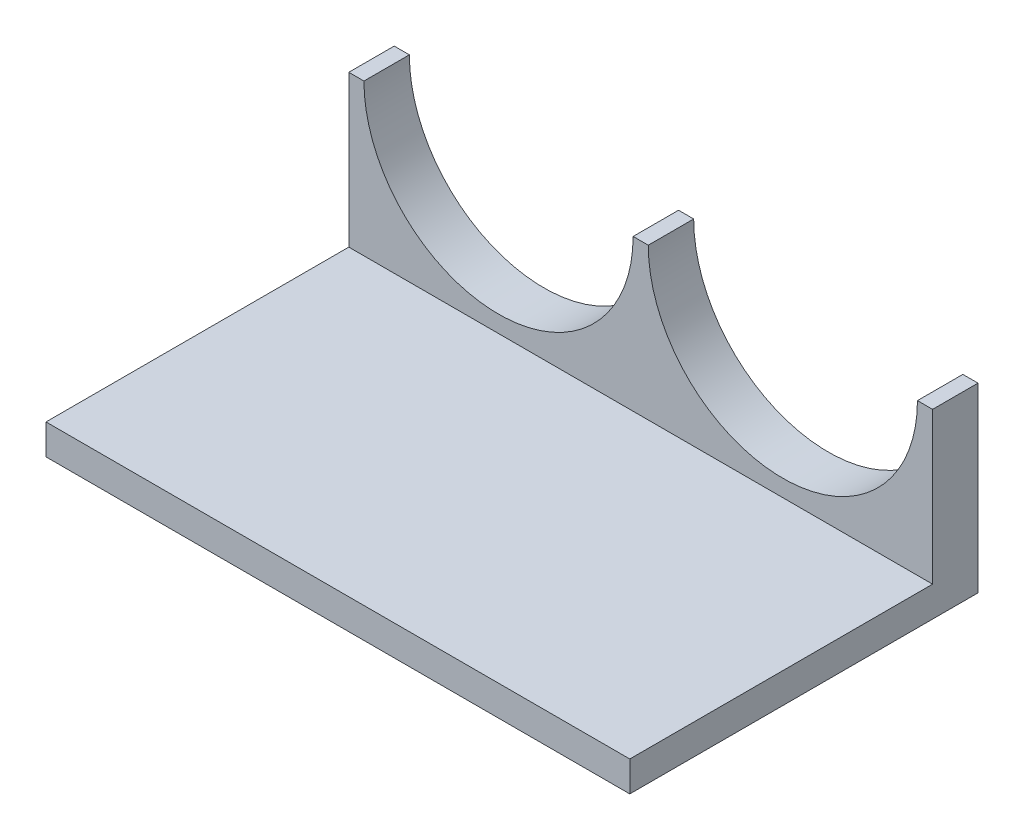
ISO-10303-21;
HEADER;
FILE_DESCRIPTION(('STEP AP214'),'2;1');
FILE_NAME('part.step','',(''),(''),'','','');
FILE_SCHEMA(('AUTOMOTIVE_DESIGN { 1 0 10303 214 1 1 1 1 }'));
ENDSEC;
DATA;
#1=APPLICATION_CONTEXT('core data for automotive mechanical design processes');
#2=APPLICATION_PROTOCOL_DEFINITION('international standard','automotive_design',2000,#1);
#3=PRODUCT_CONTEXT('',#1,'mechanical');
#4=PRODUCT('Part','Part','',(#3));
#5=PRODUCT_RELATED_PRODUCT_CATEGORY('part','',(#4));
#6=PRODUCT_DEFINITION_FORMATION('','',#4);
#7=PRODUCT_DEFINITION_CONTEXT('part definition',#1,'design');
#8=PRODUCT_DEFINITION('design','',#6,#7);
#9=PRODUCT_DEFINITION_SHAPE('','',#8);
#10=(LENGTH_UNIT() NAMED_UNIT(*) SI_UNIT(.MILLI.,.METRE.));
#11=(NAMED_UNIT(*) PLANE_ANGLE_UNIT() SI_UNIT($,.RADIAN.));
#12=(NAMED_UNIT(*) SI_UNIT($,.STERADIAN.) SOLID_ANGLE_UNIT());
#13=UNCERTAINTY_MEASURE_WITH_UNIT(LENGTH_MEASURE(1.E-05),#10,'distance_accuracy_value','');
#14=(GEOMETRIC_REPRESENTATION_CONTEXT(3) GLOBAL_UNCERTAINTY_ASSIGNED_CONTEXT((#13)) GLOBAL_UNIT_ASSIGNED_CONTEXT((#10,
#11,#12)) REPRESENTATION_CONTEXT('',''));
#15=CARTESIAN_POINT('',(0.,0.,0.));
#16=DIRECTION('',(0.,0.,1.));
#17=DIRECTION('',(1.,0.,0.));
#18=AXIS2_PLACEMENT_3D('',#15,#16,#17);
#19=CARTESIAN_POINT('',(0.,0.,15.));
#20=DIRECTION('',(0.,1.,0.));
#21=DIRECTION('',(0.,0.,1.));
#22=AXIS2_PLACEMENT_3D('',#19,#20,#21);
#23=PLANE('',#22);
#24=DIRECTION('',(1.,0.,0.));
#25=VECTOR('',#24,1.);
#26=CARTESIAN_POINT('',(0.,0.,0.));
#27=LINE('',#26,#25);
#28=CARTESIAN_POINT('',(0.,0.,0.));
#29=VERTEX_POINT('',#28);
#30=CARTESIAN_POINT('',(192.8,0.,0.));
#31=VERTEX_POINT('',#30);
#32=EDGE_CURVE('E151',#29,#31,#27,.T.);
#33=ORIENTED_EDGE('',*,*,#32,.T.);
#34=DIRECTION('',(0.,0.,-1.));
#35=VECTOR('',#34,1.);
#36=CARTESIAN_POINT('',(192.8,0.,15.));
#37=LINE('',#36,#35);
#38=CARTESIAN_POINT('',(192.8,0.,115.));
#39=VERTEX_POINT('',#38);
#40=EDGE_CURVE('E52',#39,#31,#37,.T.);
#41=ORIENTED_EDGE('',*,*,#40,.F.);
#42=DIRECTION('',(1.,0.,0.));
#43=VECTOR('',#42,1.);
#44=CARTESIAN_POINT('',(0.,0.,115.));
#45=LINE('',#44,#43);
#46=CARTESIAN_POINT('',(0.,0.,115.));
#47=VERTEX_POINT('',#46);
#48=EDGE_CURVE('E237',#47,#39,#45,.T.);
#49=ORIENTED_EDGE('',*,*,#48,.F.);
#50=DIRECTION('',(0.,0.,-1.));
#51=VECTOR('',#50,1.);
#52=CARTESIAN_POINT('',(0.,0.,15.));
#53=LINE('',#52,#51);
#54=EDGE_CURVE('E11',#47,#29,#53,.T.);
#55=ORIENTED_EDGE('',*,*,#54,.T.);
#56=EDGE_LOOP('',(#33,#41,#49,#55));
#57=FACE_BOUND('',#56,.T.);
#58=ADVANCED_FACE('F44',(#57),#23,.F.);
#59=CARTESIAN_POINT('',(192.8,60.,15.));
#60=DIRECTION('',(-1.,0.,0.));
#61=DIRECTION('',(0.,-1.,0.));
#62=AXIS2_PLACEMENT_3D('',#59,#60,#61);
#63=PLANE('',#62);
#64=DIRECTION('',(0.,1.,0.));
#65=VECTOR('',#64,1.);
#66=CARTESIAN_POINT('',(192.8,60.,0.));
#67=LINE('',#66,#65);
#68=CARTESIAN_POINT('',(192.8,60.,0.));
#69=VERTEX_POINT('',#68);
#70=EDGE_CURVE('E154',#31,#69,#67,.T.);
#71=ORIENTED_EDGE('',*,*,#70,.T.);
#72=DIRECTION('',(0.,0.,-1.));
#73=VECTOR('',#72,1.);
#74=CARTESIAN_POINT('',(192.8,60.,15.));
#75=LINE('',#74,#73);
#76=CARTESIAN_POINT('',(192.8,60.,15.));
#77=VERTEX_POINT('',#76);
#78=EDGE_CURVE('E184',#77,#69,#75,.T.);
#79=ORIENTED_EDGE('',*,*,#78,.F.);
#80=DIRECTION('',(0.,1.,0.));
#81=VECTOR('',#80,1.);
#82=CARTESIAN_POINT('',(192.8,60.,15.));
#83=LINE('',#82,#81);
#84=CARTESIAN_POINT('',(192.8,10.,15.));
#85=VERTEX_POINT('',#84);
#86=EDGE_CURVE('E106',#85,#77,#83,.T.);
#87=ORIENTED_EDGE('',*,*,#86,.F.);
#88=DIRECTION('',(0.,0.,-1.));
#89=VECTOR('',#88,1.);
#90=CARTESIAN_POINT('',(192.8,10.,115.));
#91=LINE('',#90,#89);
#92=CARTESIAN_POINT('',(192.8,10.,115.));
#93=VERTEX_POINT('',#92);
#94=EDGE_CURVE('E155',#93,#85,#91,.T.);
#95=ORIENTED_EDGE('',*,*,#94,.F.);
#96=DIRECTION('',(0.,1.,0.));
#97=VECTOR('',#96,1.);
#98=CARTESIAN_POINT('',(192.8,0.,115.));
#99=LINE('',#98,#97);
#100=EDGE_CURVE('E197',#39,#93,#99,.T.);
#101=ORIENTED_EDGE('',*,*,#100,.F.);
#102=ORIENTED_EDGE('',*,*,#40,.T.);
#103=EDGE_LOOP('',(#71,#79,#87,#95,#101,#102));
#104=FACE_BOUND('',#103,.T.);
#105=ADVANCED_FACE('F193',(#104),#63,.F.);
#106=CARTESIAN_POINT('',(187.8,60.,15.));
#107=DIRECTION('',(0.,-1.,0.));
#108=DIRECTION('',(0.,0.,-1.));
#109=AXIS2_PLACEMENT_3D('',#106,#107,#108);
#110=PLANE('',#109);
#111=DIRECTION('',(-1.,0.,0.));
#112=VECTOR('',#111,1.);
#113=CARTESIAN_POINT('',(187.8,60.,0.));
#114=LINE('',#113,#112);
#115=CARTESIAN_POINT('',(187.8,60.,0.));
#116=VERTEX_POINT('',#115);
#117=EDGE_CURVE('E158',#69,#116,#114,.T.);
#118=ORIENTED_EDGE('',*,*,#117,.T.);
#119=DIRECTION('',(0.,0.,-1.));
#120=VECTOR('',#119,1.);
#121=CARTESIAN_POINT('',(187.8,60.,15.));
#122=LINE('',#121,#120);
#123=CARTESIAN_POINT('',(187.8,60.,15.));
#124=VERTEX_POINT('',#123);
#125=EDGE_CURVE('E180',#124,#116,#122,.T.);
#126=ORIENTED_EDGE('',*,*,#125,.F.);
#127=DIRECTION('',(-1.,0.,0.));
#128=VECTOR('',#127,1.);
#129=CARTESIAN_POINT('',(187.8,60.,15.));
#130=LINE('',#129,#128);
#131=EDGE_CURVE('E214',#77,#124,#130,.T.);
#132=ORIENTED_EDGE('',*,*,#131,.F.);
#133=ORIENTED_EDGE('',*,*,#78,.T.);
#134=EDGE_LOOP('',(#118,#126,#132,#133));
#135=FACE_BOUND('',#134,.T.);
#136=ADVANCED_FACE('F209',(#135),#110,.F.);
#137=CARTESIAN_POINT('',(143.35,60.,15.));
#138=DIRECTION('',(0.,0.,-1.));
#139=DIRECTION('',(-1.,0.,0.));
#140=AXIS2_PLACEMENT_3D('',#137,#138,#139);
#141=CYLINDRICAL_SURFACE('',#140,44.45);
#142=CARTESIAN_POINT('',(143.35,60.,0.));
#143=DIRECTION('',(0.,0.,-1.));
#144=DIRECTION('',(1.,0.,0.));
#145=AXIS2_PLACEMENT_3D('',#142,#143,#144);
#146=CIRCLE('',#145,44.45);
#147=CARTESIAN_POINT('',(98.9,60.,0.));
#148=VERTEX_POINT('',#147);
#149=EDGE_CURVE('E161',#116,#148,#146,.T.);
#150=ORIENTED_EDGE('',*,*,#149,.T.);
#151=DIRECTION('',(0.,0.,-1.));
#152=VECTOR('',#151,1.);
#153=CARTESIAN_POINT('',(98.9,60.,15.));
#154=LINE('',#153,#152);
#155=CARTESIAN_POINT('',(98.9,60.,15.));
#156=VERTEX_POINT('',#155);
#157=EDGE_CURVE('E138',#156,#148,#154,.T.);
#158=ORIENTED_EDGE('',*,*,#157,.F.);
#159=CARTESIAN_POINT('',(143.35,60.,15.));
#160=DIRECTION('',(0.,0.,-1.));
#161=DIRECTION('',(1.,0.,0.));
#162=AXIS2_PLACEMENT_3D('',#159,#160,#161);
#163=CIRCLE('',#162,44.45);
#164=EDGE_CURVE('E124',#124,#156,#163,.T.);
#165=ORIENTED_EDGE('',*,*,#164,.F.);
#166=ORIENTED_EDGE('',*,*,#125,.T.);
#167=EDGE_LOOP('',(#150,#158,#165,#166));
#168=FACE_BOUND('',#167,.T.);
#169=ADVANCED_FACE('F212',(#168),#141,.F.);
#170=CARTESIAN_POINT('',(93.9,60.,15.));
#171=DIRECTION('',(0.,-1.,0.));
#172=DIRECTION('',(0.,0.,-1.));
#173=AXIS2_PLACEMENT_3D('',#170,#171,#172);
#174=PLANE('',#173);
#175=DIRECTION('',(-1.,0.,0.));
#176=VECTOR('',#175,1.);
#177=CARTESIAN_POINT('',(93.9,60.,0.));
#178=LINE('',#177,#176);
#179=CARTESIAN_POINT('',(93.9,60.,0.));
#180=VERTEX_POINT('',#179);
#181=EDGE_CURVE('E134',#148,#180,#178,.T.);
#182=ORIENTED_EDGE('',*,*,#181,.T.);
#183=DIRECTION('',(0.,0.,-1.));
#184=VECTOR('',#183,1.);
#185=CARTESIAN_POINT('',(93.9,60.,15.));
#186=LINE('',#185,#184);
#187=CARTESIAN_POINT('',(93.9,60.,15.));
#188=VERTEX_POINT('',#187);
#189=EDGE_CURVE('E131',#188,#180,#186,.T.);
#190=ORIENTED_EDGE('',*,*,#189,.F.);
#191=DIRECTION('',(-1.,0.,0.));
#192=VECTOR('',#191,1.);
#193=CARTESIAN_POINT('',(93.9,60.,15.));
#194=LINE('',#193,#192);
#195=EDGE_CURVE('E117',#156,#188,#194,.T.);
#196=ORIENTED_EDGE('',*,*,#195,.F.);
#197=ORIENTED_EDGE('',*,*,#157,.T.);
#198=EDGE_LOOP('',(#182,#190,#196,#197));
#199=FACE_BOUND('',#198,.T.);
#200=ADVANCED_FACE('F132',(#199),#174,.F.);
#201=CARTESIAN_POINT('',(49.45,60.,15.));
#202=DIRECTION('',(0.,0.,-1.));
#203=DIRECTION('',(-1.,0.,0.));
#204=AXIS2_PLACEMENT_3D('',#201,#202,#203);
#205=CYLINDRICAL_SURFACE('',#204,44.45);
#206=CARTESIAN_POINT('',(49.45,60.,0.));
#207=DIRECTION('',(0.,0.,-1.));
#208=DIRECTION('',(1.,0.,0.));
#209=AXIS2_PLACEMENT_3D('',#206,#207,#208);
#210=CIRCLE('',#209,44.45);
#211=CARTESIAN_POINT('',(5.,60.,0.));
#212=VERTEX_POINT('',#211);
#213=EDGE_CURVE('E166',#180,#212,#210,.T.);
#214=ORIENTED_EDGE('',*,*,#213,.T.);
#215=DIRECTION('',(0.,0.,-1.));
#216=VECTOR('',#215,1.);
#217=CARTESIAN_POINT('',(5.,60.,15.));
#218=LINE('',#217,#216);
#219=CARTESIAN_POINT('',(5.,60.,15.));
#220=VERTEX_POINT('',#219);
#221=EDGE_CURVE('E139',#220,#212,#218,.T.);
#222=ORIENTED_EDGE('',*,*,#221,.F.);
#223=CARTESIAN_POINT('',(49.45,60.,15.));
#224=DIRECTION('',(0.,0.,-1.));
#225=DIRECTION('',(1.,0.,0.));
#226=AXIS2_PLACEMENT_3D('',#223,#224,#225);
#227=CIRCLE('',#226,44.45);
#228=EDGE_CURVE('E121',#188,#220,#227,.T.);
#229=ORIENTED_EDGE('',*,*,#228,.F.);
#230=ORIENTED_EDGE('',*,*,#189,.T.);
#231=EDGE_LOOP('',(#214,#222,#229,#230));
#232=FACE_BOUND('',#231,.T.);
#233=ADVANCED_FACE('F141',(#232),#205,.F.);
#234=CARTESIAN_POINT('',(0.,60.,15.));
#235=DIRECTION('',(0.,-1.,0.));
#236=DIRECTION('',(1.,0.,0.));
#237=AXIS2_PLACEMENT_3D('',#234,#235,#236);
#238=PLANE('',#237);
#239=DIRECTION('',(-1.,0.,0.));
#240=VECTOR('',#239,1.);
#241=CARTESIAN_POINT('',(0.,60.,0.));
#242=LINE('',#241,#240);
#243=CARTESIAN_POINT('',(0.,60.,0.));
#244=VERTEX_POINT('',#243);
#245=EDGE_CURVE('E102',#212,#244,#242,.T.);
#246=ORIENTED_EDGE('',*,*,#245,.T.);
#247=DIRECTION('',(0.,0.,-1.));
#248=VECTOR('',#247,1.);
#249=CARTESIAN_POINT('',(0.,60.,15.));
#250=LINE('',#249,#248);
#251=CARTESIAN_POINT('',(0.,60.,15.));
#252=VERTEX_POINT('',#251);
#253=EDGE_CURVE('E147',#252,#244,#250,.T.);
#254=ORIENTED_EDGE('',*,*,#253,.F.);
#255=DIRECTION('',(-1.,0.,0.));
#256=VECTOR('',#255,1.);
#257=CARTESIAN_POINT('',(0.,60.,15.));
#258=LINE('',#257,#256);
#259=EDGE_CURVE('E144',#220,#252,#258,.T.);
#260=ORIENTED_EDGE('',*,*,#259,.F.);
#261=ORIENTED_EDGE('',*,*,#221,.T.);
#262=EDGE_LOOP('',(#246,#254,#260,#261));
#263=FACE_BOUND('',#262,.T.);
#264=ADVANCED_FACE('F256',(#263),#238,.F.);
#265=CARTESIAN_POINT('',(0.,10.,15.));
#266=DIRECTION('',(1.,0.,0.));
#267=DIRECTION('',(0.,0.,-1.));
#268=AXIS2_PLACEMENT_3D('',#265,#266,#267);
#269=PLANE('',#268);
#270=DIRECTION('',(0.,-1.,0.));
#271=VECTOR('',#270,1.);
#272=CARTESIAN_POINT('',(0.,10.,0.));
#273=LINE('',#272,#271);
#274=EDGE_CURVE('E171',#244,#29,#273,.T.);
#275=ORIENTED_EDGE('',*,*,#274,.T.);
#276=ORIENTED_EDGE('',*,*,#54,.F.);
#277=DIRECTION('',(0.,-1.,0.));
#278=VECTOR('',#277,1.);
#279=CARTESIAN_POINT('',(0.,0.,115.));
#280=LINE('',#279,#278);
#281=CARTESIAN_POINT('',(0.,10.,115.));
#282=VERTEX_POINT('',#281);
#283=EDGE_CURVE('E231',#282,#47,#280,.T.);
#284=ORIENTED_EDGE('',*,*,#283,.F.);
#285=DIRECTION('',(0.,0.,-1.));
#286=VECTOR('',#285,1.);
#287=CARTESIAN_POINT('',(0.,10.,115.));
#288=LINE('',#287,#286);
#289=CARTESIAN_POINT('',(0.,10.,15.));
#290=VERTEX_POINT('',#289);
#291=EDGE_CURVE('E225',#282,#290,#288,.T.);
#292=ORIENTED_EDGE('',*,*,#291,.T.);
#293=DIRECTION('',(0.,-1.,0.));
#294=VECTOR('',#293,1.);
#295=CARTESIAN_POINT('',(0.,10.,15.));
#296=LINE('',#295,#294);
#297=EDGE_CURVE('E67',#252,#290,#296,.T.);
#298=ORIENTED_EDGE('',*,*,#297,.F.);
#299=ORIENTED_EDGE('',*,*,#253,.T.);
#300=EDGE_LOOP('',(#275,#276,#284,#292,#298,#299));
#301=FACE_BOUND('',#300,.T.);
#302=ADVANCED_FACE('F250',(#301),#269,.F.);
#303=CARTESIAN_POINT('',(143.35,60.,15.));
#304=DIRECTION('',(0.,0.,1.));
#305=DIRECTION('',(1.,0.,0.));
#306=AXIS2_PLACEMENT_3D('',#303,#304,#305);
#307=PLANE('',#306);
#308=DIRECTION('',(-1.,0.,0.));
#309=VECTOR('',#308,1.);
#310=CARTESIAN_POINT('',(0.,10.,15.));
#311=LINE('',#310,#309);
#312=EDGE_CURVE('E59',#85,#290,#311,.T.);
#313=ORIENTED_EDGE('',*,*,#312,.F.);
#314=ORIENTED_EDGE('',*,*,#86,.T.);
#315=ORIENTED_EDGE('',*,*,#131,.T.);
#316=ORIENTED_EDGE('',*,*,#164,.T.);
#317=ORIENTED_EDGE('',*,*,#195,.T.);
#318=ORIENTED_EDGE('',*,*,#228,.T.);
#319=ORIENTED_EDGE('',*,*,#259,.T.);
#320=ORIENTED_EDGE('',*,*,#297,.T.);
#321=EDGE_LOOP('',(#313,#314,#315,#316,#317,#318,#319,#320));
#322=FACE_BOUND('',#321,.T.);
#323=ADVANCED_FACE('F119',(#322),#307,.T.);
#324=CARTESIAN_POINT('',(143.35,60.,0.));
#325=DIRECTION('',(0.,0.,1.));
#326=DIRECTION('',(1.,0.,0.));
#327=AXIS2_PLACEMENT_3D('',#324,#325,#326);
#328=PLANE('',#327);
#329=ORIENTED_EDGE('',*,*,#32,.F.);
#330=ORIENTED_EDGE('',*,*,#274,.F.);
#331=ORIENTED_EDGE('',*,*,#245,.F.);
#332=ORIENTED_EDGE('',*,*,#213,.F.);
#333=ORIENTED_EDGE('',*,*,#181,.F.);
#334=ORIENTED_EDGE('',*,*,#149,.F.);
#335=ORIENTED_EDGE('',*,*,#117,.F.);
#336=ORIENTED_EDGE('',*,*,#70,.F.);
#337=EDGE_LOOP('',(#329,#330,#331,#332,#333,#334,#335,#336));
#338=FACE_BOUND('',#337,.T.);
#339=ADVANCED_FACE('F204',(#338),#328,.F.);
#340=CARTESIAN_POINT('',(0.,10.,115.));
#341=DIRECTION('',(0.,-1.,0.));
#342=DIRECTION('',(0.,0.,-1.));
#343=AXIS2_PLACEMENT_3D('',#340,#341,#342);
#344=PLANE('',#343);
#345=ORIENTED_EDGE('',*,*,#312,.T.);
#346=ORIENTED_EDGE('',*,*,#291,.F.);
#347=DIRECTION('',(-1.,0.,0.));
#348=VECTOR('',#347,1.);
#349=CARTESIAN_POINT('',(0.,10.,115.));
#350=LINE('',#349,#348);
#351=EDGE_CURVE('E228',#93,#282,#350,.T.);
#352=ORIENTED_EDGE('',*,*,#351,.F.);
#353=ORIENTED_EDGE('',*,*,#94,.T.);
#354=EDGE_LOOP('',(#345,#346,#352,#353));
#355=FACE_BOUND('',#354,.T.);
#356=ADVANCED_FACE('F255',(#355),#344,.F.);
#357=CARTESIAN_POINT('',(0.,0.,115.));
#358=DIRECTION('',(0.,0.,-1.));
#359=DIRECTION('',(-1.,0.,0.));
#360=AXIS2_PLACEMENT_3D('',#357,#358,#359);
#361=PLANE('',#360);
#362=ORIENTED_EDGE('',*,*,#283,.T.);
#363=ORIENTED_EDGE('',*,*,#48,.T.);
#364=ORIENTED_EDGE('',*,*,#100,.T.);
#365=ORIENTED_EDGE('',*,*,#351,.T.);
#366=EDGE_LOOP('',(#362,#363,#364,#365));
#367=FACE_BOUND('',#366,.T.);
#368=ADVANCED_FACE('F245',(#367),#361,.F.);
#369=CLOSED_SHELL('',(#58,#105,#136,#169,#200,#233,#264,#302,#323,#339,#356,#368));
#370=MANIFOLD_SOLID_BREP('B2',#369);
#371=ADVANCED_BREP_SHAPE_REPRESENTATION('',(#18,#370),#14);
#372=SHAPE_DEFINITION_REPRESENTATION(#9,#371);
ENDSEC;
END-ISO-10303-21;
